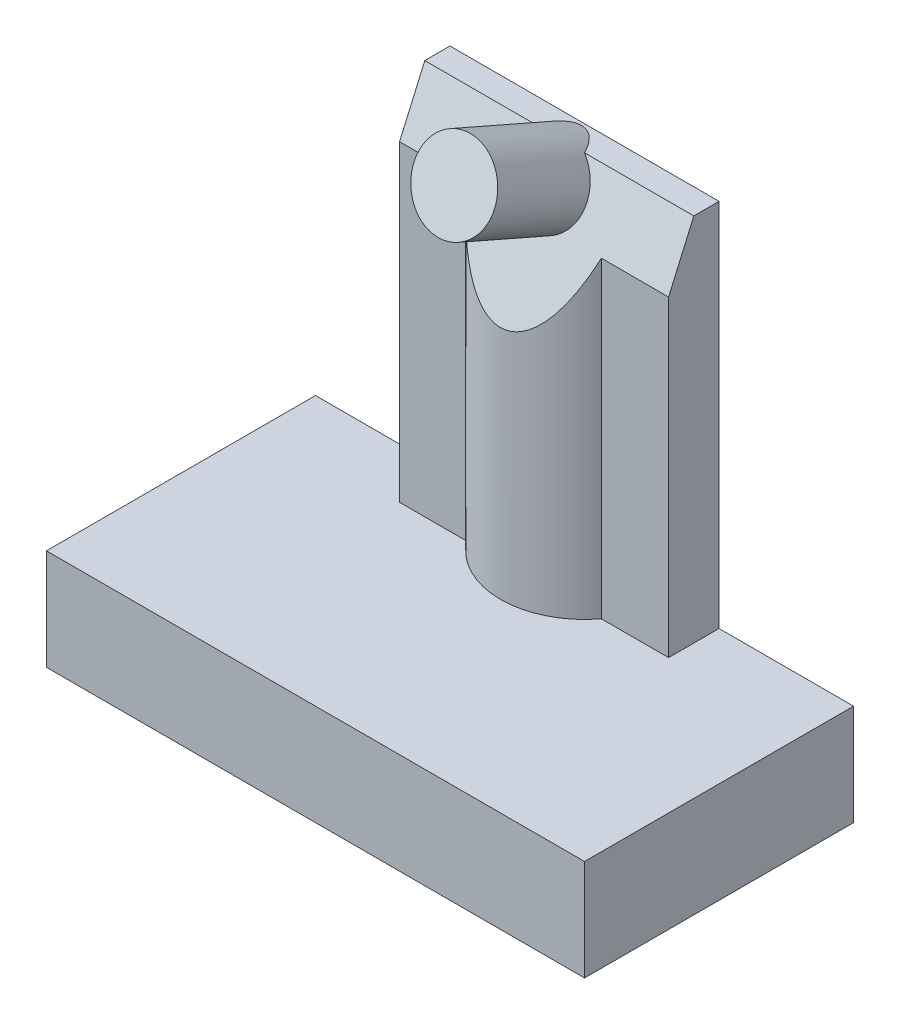
ISO-10303-21;
HEADER;
FILE_DESCRIPTION(('STEP AP214'),'2;1');
FILE_NAME('part.step','',(''),(''),'','','');
FILE_SCHEMA(('AUTOMOTIVE_DESIGN { 1 0 10303 214 1 1 1 1 }'));
ENDSEC;
DATA;
#1=APPLICATION_CONTEXT('core data for automotive mechanical design processes');
#2=APPLICATION_PROTOCOL_DEFINITION('international standard','automotive_design',2000,#1);
#3=PRODUCT_CONTEXT('',#1,'mechanical');
#4=PRODUCT('Part','Part','',(#3));
#5=PRODUCT_RELATED_PRODUCT_CATEGORY('part','',(#4));
#6=PRODUCT_DEFINITION_FORMATION('','',#4);
#7=PRODUCT_DEFINITION_CONTEXT('part definition',#1,'design');
#8=PRODUCT_DEFINITION('design','',#6,#7);
#9=PRODUCT_DEFINITION_SHAPE('','',#8);
#10=(LENGTH_UNIT() NAMED_UNIT(*) SI_UNIT(.MILLI.,.METRE.));
#11=(NAMED_UNIT(*) PLANE_ANGLE_UNIT() SI_UNIT($,.RADIAN.));
#12=(NAMED_UNIT(*) SI_UNIT($,.STERADIAN.) SOLID_ANGLE_UNIT());
#13=UNCERTAINTY_MEASURE_WITH_UNIT(LENGTH_MEASURE(1.E-05),#10,'distance_accuracy_value','');
#14=(GEOMETRIC_REPRESENTATION_CONTEXT(3) GLOBAL_UNCERTAINTY_ASSIGNED_CONTEXT((#13)) GLOBAL_UNIT_ASSIGNED_CONTEXT((#10,
#11,#12)) REPRESENTATION_CONTEXT('',''));
#15=CARTESIAN_POINT('',(0.,0.,0.));
#16=DIRECTION('',(0.,0.,1.));
#17=DIRECTION('',(1.,0.,0.));
#18=AXIS2_PLACEMENT_3D('',#15,#16,#17);
#19=CARTESIAN_POINT('',(0.,3.,0.));
#20=DIRECTION('',(0.,1.,0.));
#21=DIRECTION('',(0.,0.,1.));
#22=AXIS2_PLACEMENT_3D('',#19,#20,#21);
#23=PLANE('',#22);
#24=DIRECTION('',(-1.,0.,0.));
#25=VECTOR('',#24,1.);
#26=CARTESIAN_POINT('',(8.,3.,-4.));
#27=LINE('',#26,#25);
#28=CARTESIAN_POINT('',(8.,3.,-4.));
#29=VERTEX_POINT('',#28);
#30=CARTESIAN_POINT('',(4.,3.,-4.));
#31=VERTEX_POINT('',#30);
#32=EDGE_CURVE('E224',#29,#31,#27,.T.);
#33=ORIENTED_EDGE('',*,*,#32,.T.);
#34=DIRECTION('',(0.,0.,1.));
#35=VECTOR('',#34,1.);
#36=CARTESIAN_POINT('',(4.,3.,-4.));
#37=LINE('',#36,#35);
#38=CARTESIAN_POINT('',(4.,3.,-2.5));
#39=VERTEX_POINT('',#38);
#40=EDGE_CURVE('E289',#31,#39,#37,.T.);
#41=ORIENTED_EDGE('',*,*,#40,.T.);
#42=DIRECTION('',(-1.,0.,0.));
#43=VECTOR('',#42,1.);
#44=CARTESIAN_POINT('',(4.,3.,-2.5));
#45=LINE('',#44,#43);
#46=CARTESIAN_POINT('',(2.,3.,-2.5));
#47=VERTEX_POINT('',#46);
#48=EDGE_CURVE('E292',#39,#47,#45,.T.);
#49=ORIENTED_EDGE('',*,*,#48,.T.);
#50=CARTESIAN_POINT('',(0.,3.,-4.));
#51=DIRECTION('',(0.,1.,0.));
#52=DIRECTION('',(0.,0.,1.));
#53=AXIS2_PLACEMENT_3D('',#50,#51,#52);
#54=CIRCLE('',#53,2.5);
#55=CARTESIAN_POINT('',(-2.,3.,-2.5));
#56=VERTEX_POINT('',#55);
#57=EDGE_CURVE('E302',#56,#47,#54,.T.);
#58=ORIENTED_EDGE('',*,*,#57,.F.);
#59=DIRECTION('',(1.,0.,0.));
#60=VECTOR('',#59,1.);
#61=CARTESIAN_POINT('',(-4.,3.,-2.5));
#62=LINE('',#61,#60);
#63=CARTESIAN_POINT('',(-4.,3.,-2.5));
#64=VERTEX_POINT('',#63);
#65=EDGE_CURVE('E304',#64,#56,#62,.T.);
#66=ORIENTED_EDGE('',*,*,#65,.F.);
#67=DIRECTION('',(0.,0.,1.));
#68=VECTOR('',#67,1.);
#69=CARTESIAN_POINT('',(-4.,3.,-4.));
#70=LINE('',#69,#68);
#71=CARTESIAN_POINT('',(-4.,3.,-4.));
#72=VERTEX_POINT('',#71);
#73=EDGE_CURVE('E281',#72,#64,#70,.T.);
#74=ORIENTED_EDGE('',*,*,#73,.F.);
#75=CARTESIAN_POINT('',(-8.,3.,-4.));
#76=VERTEX_POINT('',#75);
#77=EDGE_CURVE('E229',#72,#76,#27,.T.);
#78=ORIENTED_EDGE('',*,*,#77,.T.);
#79=DIRECTION('',(0.,0.,1.));
#80=VECTOR('',#79,1.);
#81=CARTESIAN_POINT('',(-8.,3.,4.));
#82=LINE('',#81,#80);
#83=CARTESIAN_POINT('',(-8.,3.,4.));
#84=VERTEX_POINT('',#83);
#85=EDGE_CURVE('E217',#76,#84,#82,.T.);
#86=ORIENTED_EDGE('',*,*,#85,.T.);
#87=DIRECTION('',(1.,0.,0.));
#88=VECTOR('',#87,1.);
#89=CARTESIAN_POINT('',(8.,3.,4.));
#90=LINE('',#89,#88);
#91=CARTESIAN_POINT('',(8.,3.,4.));
#92=VERTEX_POINT('',#91);
#93=EDGE_CURVE('E275',#84,#92,#90,.T.);
#94=ORIENTED_EDGE('',*,*,#93,.T.);
#95=DIRECTION('',(0.,0.,-1.));
#96=VECTOR('',#95,1.);
#97=CARTESIAN_POINT('',(8.,3.,4.));
#98=LINE('',#97,#96);
#99=EDGE_CURVE('E211',#92,#29,#98,.T.);
#100=ORIENTED_EDGE('',*,*,#99,.T.);
#101=EDGE_LOOP('',(#33,#41,#49,#58,#66,#74,#78,#86,#94,#100));
#102=FACE_BOUND('',#101,.T.);
#103=ADVANCED_FACE('F32',(#102),#23,.T.);
#104=CARTESIAN_POINT('',(-8.,3.,4.));
#105=DIRECTION('',(1.,0.,0.));
#106=DIRECTION('',(0.,0.,-1.));
#107=AXIS2_PLACEMENT_3D('',#104,#105,#106);
#108=PLANE('',#107);
#109=DIRECTION('',(0.,0.,1.));
#110=VECTOR('',#109,1.);
#111=CARTESIAN_POINT('',(-8.,0.,4.));
#112=LINE('',#111,#110);
#113=CARTESIAN_POINT('',(-8.,0.,-4.));
#114=VERTEX_POINT('',#113);
#115=CARTESIAN_POINT('',(-8.,0.,4.));
#116=VERTEX_POINT('',#115);
#117=EDGE_CURVE('E207',#114,#116,#112,.T.);
#118=ORIENTED_EDGE('',*,*,#117,.T.);
#119=DIRECTION('',(0.,-1.,0.));
#120=VECTOR('',#119,1.);
#121=CARTESIAN_POINT('',(-8.,3.,4.));
#122=LINE('',#121,#120);
#123=EDGE_CURVE('E201',#84,#116,#122,.T.);
#124=ORIENTED_EDGE('',*,*,#123,.F.);
#125=ORIENTED_EDGE('',*,*,#85,.F.);
#126=DIRECTION('',(0.,-1.,0.));
#127=VECTOR('',#126,1.);
#128=CARTESIAN_POINT('',(-8.,3.,-4.));
#129=LINE('',#128,#127);
#130=EDGE_CURVE('E221',#76,#114,#129,.T.);
#131=ORIENTED_EDGE('',*,*,#130,.T.);
#132=EDGE_LOOP('',(#118,#124,#125,#131));
#133=FACE_BOUND('',#132,.T.);
#134=ADVANCED_FACE('F34',(#133),#108,.F.);
#135=CARTESIAN_POINT('',(8.,3.,4.));
#136=DIRECTION('',(0.,0.,-1.));
#137=DIRECTION('',(-1.,0.,0.));
#138=AXIS2_PLACEMENT_3D('',#135,#136,#137);
#139=PLANE('',#138);
#140=DIRECTION('',(1.,0.,0.));
#141=VECTOR('',#140,1.);
#142=CARTESIAN_POINT('',(8.,0.,4.));
#143=LINE('',#142,#141);
#144=CARTESIAN_POINT('',(8.,0.,4.));
#145=VERTEX_POINT('',#144);
#146=EDGE_CURVE('E196',#116,#145,#143,.T.);
#147=ORIENTED_EDGE('',*,*,#146,.T.);
#148=DIRECTION('',(0.,-1.,0.));
#149=VECTOR('',#148,1.);
#150=CARTESIAN_POINT('',(8.,3.,4.));
#151=LINE('',#150,#149);
#152=EDGE_CURVE('E198',#92,#145,#151,.T.);
#153=ORIENTED_EDGE('',*,*,#152,.F.);
#154=ORIENTED_EDGE('',*,*,#93,.F.);
#155=ORIENTED_EDGE('',*,*,#123,.T.);
#156=EDGE_LOOP('',(#147,#153,#154,#155));
#157=FACE_BOUND('',#156,.T.);
#158=ADVANCED_FACE('F172',(#157),#139,.F.);
#159=CARTESIAN_POINT('',(8.,3.,4.));
#160=DIRECTION('',(-1.,0.,0.));
#161=DIRECTION('',(0.,0.,1.));
#162=AXIS2_PLACEMENT_3D('',#159,#160,#161);
#163=PLANE('',#162);
#164=DIRECTION('',(0.,0.,-1.));
#165=VECTOR('',#164,1.);
#166=CARTESIAN_POINT('',(8.,0.,4.));
#167=LINE('',#166,#165);
#168=CARTESIAN_POINT('',(8.,0.,-4.));
#169=VERTEX_POINT('',#168);
#170=EDGE_CURVE('E206',#145,#169,#167,.T.);
#171=ORIENTED_EDGE('',*,*,#170,.T.);
#172=DIRECTION('',(0.,-1.,0.));
#173=VECTOR('',#172,1.);
#174=CARTESIAN_POINT('',(8.,3.,-4.));
#175=LINE('',#174,#173);
#176=EDGE_CURVE('E212',#29,#169,#175,.T.);
#177=ORIENTED_EDGE('',*,*,#176,.F.);
#178=ORIENTED_EDGE('',*,*,#99,.F.);
#179=ORIENTED_EDGE('',*,*,#152,.T.);
#180=EDGE_LOOP('',(#171,#177,#178,#179));
#181=FACE_BOUND('',#180,.T.);
#182=ADVANCED_FACE('F186',(#181),#163,.F.);
#183=CARTESIAN_POINT('',(8.,3.,-4.));
#184=DIRECTION('',(0.,0.,1.));
#185=DIRECTION('',(1.,0.,0.));
#186=AXIS2_PLACEMENT_3D('',#183,#184,#185);
#187=PLANE('',#186);
#188=DIRECTION('',(-1.,0.,0.));
#189=VECTOR('',#188,1.);
#190=CARTESIAN_POINT('',(8.,0.,-4.));
#191=LINE('',#190,#189);
#192=EDGE_CURVE('E215',#169,#114,#191,.T.);
#193=ORIENTED_EDGE('',*,*,#192,.T.);
#194=ORIENTED_EDGE('',*,*,#130,.F.);
#195=ORIENTED_EDGE('',*,*,#77,.F.);
#196=DIRECTION('',(0.,-1.,0.));
#197=VECTOR('',#196,1.);
#198=CARTESIAN_POINT('',(-4.,14.,-4.));
#199=LINE('',#198,#197);
#200=CARTESIAN_POINT('',(-4.,14.,-4.));
#201=VERTEX_POINT('',#200);
#202=EDGE_CURVE('E314',#201,#72,#199,.T.);
#203=ORIENTED_EDGE('',*,*,#202,.F.);
#204=DIRECTION('',(1.,0.,0.));
#205=VECTOR('',#204,1.);
#206=CARTESIAN_POINT('',(-4.,14.,-4.));
#207=LINE('',#206,#205);
#208=CARTESIAN_POINT('',(4.,14.,-4.));
#209=VERTEX_POINT('',#208);
#210=EDGE_CURVE('E316',#201,#209,#207,.T.);
#211=ORIENTED_EDGE('',*,*,#210,.T.);
#212=DIRECTION('',(0.,-1.,0.));
#213=VECTOR('',#212,1.);
#214=CARTESIAN_POINT('',(4.,14.,-4.));
#215=LINE('',#214,#213);
#216=EDGE_CURVE('E266',#209,#31,#215,.T.);
#217=ORIENTED_EDGE('',*,*,#216,.T.);
#218=ORIENTED_EDGE('',*,*,#32,.F.);
#219=ORIENTED_EDGE('',*,*,#176,.T.);
#220=EDGE_LOOP('',(#193,#194,#195,#203,#211,#217,#218,#219));
#221=FACE_BOUND('',#220,.T.);
#222=ADVANCED_FACE('F182',(#221),#187,.F.);
#223=CARTESIAN_POINT('',(0.,0.,0.));
#224=DIRECTION('',(0.,1.,0.));
#225=DIRECTION('',(0.,0.,1.));
#226=AXIS2_PLACEMENT_3D('',#223,#224,#225);
#227=PLANE('',#226);
#228=DIRECTION('',(-1.,0.,0.));
#229=VECTOR('',#228,1.);
#230=CARTESIAN_POINT('',(8.,0.,-3.));
#231=LINE('',#230,#229);
#232=CARTESIAN_POINT('',(7.,0.,-3.));
#233=VERTEX_POINT('',#232);
#234=CARTESIAN_POINT('',(-7.,0.,-3.));
#235=VERTEX_POINT('',#234);
#236=EDGE_CURVE('E254',#233,#235,#231,.T.);
#237=ORIENTED_EDGE('',*,*,#236,.T.);
#238=DIRECTION('',(0.,0.,1.));
#239=VECTOR('',#238,1.);
#240=CARTESIAN_POINT('',(-7.,0.,4.));
#241=LINE('',#240,#239);
#242=CARTESIAN_POINT('',(-7.,0.,3.));
#243=VERTEX_POINT('',#242);
#244=EDGE_CURVE('E263',#235,#243,#241,.T.);
#245=ORIENTED_EDGE('',*,*,#244,.T.);
#246=DIRECTION('',(1.,0.,0.));
#247=VECTOR('',#246,1.);
#248=CARTESIAN_POINT('',(8.,0.,3.));
#249=LINE('',#248,#247);
#250=CARTESIAN_POINT('',(7.,0.,3.));
#251=VERTEX_POINT('',#250);
#252=EDGE_CURVE('E265',#243,#251,#249,.T.);
#253=ORIENTED_EDGE('',*,*,#252,.T.);
#254=DIRECTION('',(0.,0.,-1.));
#255=VECTOR('',#254,1.);
#256=CARTESIAN_POINT('',(7.,0.,4.));
#257=LINE('',#256,#255);
#258=EDGE_CURVE('E269',#251,#233,#257,.T.);
#259=ORIENTED_EDGE('',*,*,#258,.T.);
#260=EDGE_LOOP('',(#237,#245,#253,#259));
#261=FACE_BOUND('',#260,.T.);
#262=ORIENTED_EDGE('',*,*,#117,.F.);
#263=ORIENTED_EDGE('',*,*,#192,.F.);
#264=ORIENTED_EDGE('',*,*,#170,.F.);
#265=ORIENTED_EDGE('',*,*,#146,.F.);
#266=EDGE_LOOP('',(#262,#263,#264,#265));
#267=FACE_BOUND('',#266,.T.);
#268=ADVANCED_FACE('F178',(#261,#267),#227,.F.);
#269=CARTESIAN_POINT('',(-7.,3.,4.));
#270=DIRECTION('',(1.,0.,0.));
#271=DIRECTION('',(0.,0.,-1.));
#272=AXIS2_PLACEMENT_3D('',#269,#270,#271);
#273=PLANE('',#272);
#274=ORIENTED_EDGE('',*,*,#244,.F.);
#275=DIRECTION('',(0.,-1.,0.));
#276=VECTOR('',#275,1.);
#277=CARTESIAN_POINT('',(-7.,3.,-3.));
#278=LINE('',#277,#276);
#279=CARTESIAN_POINT('',(-7.,2.,-3.));
#280=VERTEX_POINT('',#279);
#281=EDGE_CURVE('E255',#280,#235,#278,.T.);
#282=ORIENTED_EDGE('',*,*,#281,.F.);
#283=DIRECTION('',(0.,0.,1.));
#284=VECTOR('',#283,1.);
#285=CARTESIAN_POINT('',(-7.,2.,4.));
#286=LINE('',#285,#284);
#287=CARTESIAN_POINT('',(-7.,2.,3.));
#288=VERTEX_POINT('',#287);
#289=EDGE_CURVE('E251',#280,#288,#286,.T.);
#290=ORIENTED_EDGE('',*,*,#289,.T.);
#291=DIRECTION('',(0.,-1.,0.));
#292=VECTOR('',#291,1.);
#293=CARTESIAN_POINT('',(-7.,3.,3.));
#294=LINE('',#293,#292);
#295=EDGE_CURVE('E235',#288,#243,#294,.T.);
#296=ORIENTED_EDGE('',*,*,#295,.T.);
#297=EDGE_LOOP('',(#274,#282,#290,#296));
#298=FACE_BOUND('',#297,.T.);
#299=ADVANCED_FACE('F181',(#298),#273,.T.);
#300=CARTESIAN_POINT('',(8.,3.,3.));
#301=DIRECTION('',(0.,0.,-1.));
#302=DIRECTION('',(-1.,0.,0.));
#303=AXIS2_PLACEMENT_3D('',#300,#301,#302);
#304=PLANE('',#303);
#305=ORIENTED_EDGE('',*,*,#252,.F.);
#306=ORIENTED_EDGE('',*,*,#295,.F.);
#307=DIRECTION('',(1.,0.,0.));
#308=VECTOR('',#307,1.);
#309=CARTESIAN_POINT('',(8.,2.,3.));
#310=LINE('',#309,#308);
#311=CARTESIAN_POINT('',(7.,2.,3.));
#312=VERTEX_POINT('',#311);
#313=EDGE_CURVE('E253',#288,#312,#310,.T.);
#314=ORIENTED_EDGE('',*,*,#313,.T.);
#315=DIRECTION('',(0.,-1.,0.));
#316=VECTOR('',#315,1.);
#317=CARTESIAN_POINT('',(7.,3.,3.));
#318=LINE('',#317,#316);
#319=EDGE_CURVE('E237',#312,#251,#318,.T.);
#320=ORIENTED_EDGE('',*,*,#319,.T.);
#321=EDGE_LOOP('',(#305,#306,#314,#320));
#322=FACE_BOUND('',#321,.T.);
#323=ADVANCED_FACE('F443',(#322),#304,.T.);
#324=CARTESIAN_POINT('',(7.,3.,4.));
#325=DIRECTION('',(-1.,0.,0.));
#326=DIRECTION('',(0.,0.,1.));
#327=AXIS2_PLACEMENT_3D('',#324,#325,#326);
#328=PLANE('',#327);
#329=ORIENTED_EDGE('',*,*,#258,.F.);
#330=ORIENTED_EDGE('',*,*,#319,.F.);
#331=DIRECTION('',(0.,0.,-1.));
#332=VECTOR('',#331,1.);
#333=CARTESIAN_POINT('',(7.,2.,4.));
#334=LINE('',#333,#332);
#335=CARTESIAN_POINT('',(7.,2.,-3.));
#336=VERTEX_POINT('',#335);
#337=EDGE_CURVE('E259',#312,#336,#334,.T.);
#338=ORIENTED_EDGE('',*,*,#337,.T.);
#339=DIRECTION('',(0.,-1.,0.));
#340=VECTOR('',#339,1.);
#341=CARTESIAN_POINT('',(7.,3.,-3.));
#342=LINE('',#341,#340);
#343=EDGE_CURVE('E245',#336,#233,#342,.T.);
#344=ORIENTED_EDGE('',*,*,#343,.T.);
#345=EDGE_LOOP('',(#329,#330,#338,#344));
#346=FACE_BOUND('',#345,.T.);
#347=ADVANCED_FACE('F434',(#346),#328,.T.);
#348=CARTESIAN_POINT('',(8.,3.,-3.));
#349=DIRECTION('',(0.,0.,1.));
#350=DIRECTION('',(1.,0.,0.));
#351=AXIS2_PLACEMENT_3D('',#348,#349,#350);
#352=PLANE('',#351);
#353=ORIENTED_EDGE('',*,*,#236,.F.);
#354=ORIENTED_EDGE('',*,*,#343,.F.);
#355=DIRECTION('',(-1.,0.,0.));
#356=VECTOR('',#355,1.);
#357=CARTESIAN_POINT('',(8.,2.,-3.));
#358=LINE('',#357,#356);
#359=EDGE_CURVE('E256',#336,#280,#358,.T.);
#360=ORIENTED_EDGE('',*,*,#359,.T.);
#361=ORIENTED_EDGE('',*,*,#281,.T.);
#362=EDGE_LOOP('',(#353,#354,#360,#361));
#363=FACE_BOUND('',#362,.T.);
#364=ADVANCED_FACE('F425',(#363),#352,.T.);
#365=CARTESIAN_POINT('',(0.,2.,0.));
#366=DIRECTION('',(0.,1.,0.));
#367=DIRECTION('',(0.,0.,1.));
#368=AXIS2_PLACEMENT_3D('',#365,#366,#367);
#369=PLANE('',#368);
#370=ORIENTED_EDGE('',*,*,#289,.F.);
#371=ORIENTED_EDGE('',*,*,#359,.F.);
#372=ORIENTED_EDGE('',*,*,#337,.F.);
#373=ORIENTED_EDGE('',*,*,#313,.F.);
#374=EDGE_LOOP('',(#370,#371,#372,#373));
#375=FACE_BOUND('',#374,.T.);
#376=ADVANCED_FACE('F176',(#375),#369,.F.);
#377=CARTESIAN_POINT('',(4.,14.,-4.));
#378=DIRECTION('',(1.,0.,0.));
#379=DIRECTION('',(0.,0.,-1.));
#380=AXIS2_PLACEMENT_3D('',#377,#378,#379);
#381=PLANE('',#380);
#382=DIRECTION('',(0.,0.916157334902189,-0.400818834019708));
#383=VECTOR('',#382,1.);
#384=CARTESIAN_POINT('',(4.,14.,-3.25));
#385=LINE('',#384,#383);
#386=CARTESIAN_POINT('',(4.,12.2857142857143,-2.5));
#387=VERTEX_POINT('',#386);
#388=CARTESIAN_POINT('',(4.,14.,-3.25));
#389=VERTEX_POINT('',#388);
#390=EDGE_CURVE('E54',#387,#389,#385,.T.);
#391=ORIENTED_EDGE('',*,*,#390,.F.);
#392=DIRECTION('',(0.,-1.,0.));
#393=VECTOR('',#392,1.);
#394=CARTESIAN_POINT('',(4.,14.,-2.5));
#395=LINE('',#394,#393);
#396=EDGE_CURVE('E249',#387,#39,#395,.T.);
#397=ORIENTED_EDGE('',*,*,#396,.T.);
#398=ORIENTED_EDGE('',*,*,#40,.F.);
#399=ORIENTED_EDGE('',*,*,#216,.F.);
#400=DIRECTION('',(0.,0.,1.));
#401=VECTOR('',#400,1.);
#402=CARTESIAN_POINT('',(4.,14.,-4.));
#403=LINE('',#402,#401);
#404=EDGE_CURVE('E319',#209,#389,#403,.T.);
#405=ORIENTED_EDGE('',*,*,#404,.T.);
#406=EDGE_LOOP('',(#391,#397,#398,#399,#405));
#407=FACE_BOUND('',#406,.T.);
#408=ADVANCED_FACE('F396',(#407),#381,.T.);
#409=CARTESIAN_POINT('',(-4.,14.,-4.));
#410=DIRECTION('',(1.,0.,0.));
#411=DIRECTION('',(0.,0.,-1.));
#412=AXIS2_PLACEMENT_3D('',#409,#410,#411);
#413=PLANE('',#412);
#414=DIRECTION('',(0.,-1.,0.));
#415=VECTOR('',#414,1.);
#416=CARTESIAN_POINT('',(-4.,14.,-2.5));
#417=LINE('',#416,#415);
#418=CARTESIAN_POINT('',(-4.,12.2857142857143,-2.5));
#419=VERTEX_POINT('',#418);
#420=EDGE_CURVE('E312',#419,#64,#417,.T.);
#421=ORIENTED_EDGE('',*,*,#420,.F.);
#422=DIRECTION('',(0.,0.916157334902189,-0.400818834019708));
#423=VECTOR('',#422,1.);
#424=CARTESIAN_POINT('',(-4.,14.2754098360656,-3.37049180327869));
#425=LINE('',#424,#423);
#426=CARTESIAN_POINT('',(-4.,14.,-3.25));
#427=VERTEX_POINT('',#426);
#428=EDGE_CURVE('E295',#419,#427,#425,.T.);
#429=ORIENTED_EDGE('',*,*,#428,.T.);
#430=DIRECTION('',(0.,0.,1.));
#431=VECTOR('',#430,1.);
#432=CARTESIAN_POINT('',(-4.,14.,-4.));
#433=LINE('',#432,#431);
#434=EDGE_CURVE('E317',#201,#427,#433,.T.);
#435=ORIENTED_EDGE('',*,*,#434,.F.);
#436=ORIENTED_EDGE('',*,*,#202,.T.);
#437=ORIENTED_EDGE('',*,*,#73,.T.);
#438=EDGE_LOOP('',(#421,#429,#435,#436,#437));
#439=FACE_BOUND('',#438,.T.);
#440=ADVANCED_FACE('F386',(#439),#413,.F.);
#441=CARTESIAN_POINT('',(-4.,14.,-2.5));
#442=DIRECTION('',(0.,0.,-1.));
#443=DIRECTION('',(-1.,0.,0.));
#444=AXIS2_PLACEMENT_3D('',#441,#442,#443);
#445=PLANE('',#444);
#446=DIRECTION('',(0.,-1.,0.));
#447=VECTOR('',#446,1.);
#448=CARTESIAN_POINT('',(-2.,14.,-2.5));
#449=LINE('',#448,#447);
#450=CARTESIAN_POINT('',(-2.,12.2857142857143,-2.5));
#451=VERTEX_POINT('',#450);
#452=EDGE_CURVE('E315',#451,#56,#449,.T.);
#453=ORIENTED_EDGE('',*,*,#452,.F.);
#454=DIRECTION('',(-1.,0.,0.));
#455=VECTOR('',#454,1.);
#456=CARTESIAN_POINT('',(-4.,12.2857142857143,-2.5));
#457=LINE('',#456,#455);
#458=EDGE_CURVE('E325',#451,#419,#457,.T.);
#459=ORIENTED_EDGE('',*,*,#458,.T.);
#460=ORIENTED_EDGE('',*,*,#420,.T.);
#461=ORIENTED_EDGE('',*,*,#65,.T.);
#462=EDGE_LOOP('',(#453,#459,#460,#461));
#463=FACE_BOUND('',#462,.T.);
#464=ADVANCED_FACE('F376',(#463),#445,.F.);
#465=CARTESIAN_POINT('',(0.,14.,-4.));
#466=DIRECTION('',(0.,-1.,0.));
#467=DIRECTION('',(0.,0.,-1.));
#468=AXIS2_PLACEMENT_3D('',#465,#466,#467);
#469=CYLINDRICAL_SURFACE('',#468,2.5);
#470=CARTESIAN_POINT('',(0.,15.7142857142857,-4.));
#471=DIRECTION('',(0.,-0.400818834019708,-0.916157334902189));
#472=DIRECTION('',(0.,-0.916157334902189,0.400818834019708));
#473=AXIS2_PLACEMENT_3D('',#470,#471,#472);
#474=ELLIPSE('',#473,6.23723185591892,2.5);
#475=CARTESIAN_POINT('',(2.,12.2857142857143,-2.5));
#476=VERTEX_POINT('',#475);
#477=EDGE_CURVE('E328',#476,#451,#474,.T.);
#478=ORIENTED_EDGE('',*,*,#477,.T.);
#479=ORIENTED_EDGE('',*,*,#452,.T.);
#480=ORIENTED_EDGE('',*,*,#57,.T.);
#481=DIRECTION('',(0.,-1.,0.));
#482=VECTOR('',#481,1.);
#483=CARTESIAN_POINT('',(2.,14.,-2.5));
#484=LINE('',#483,#482);
#485=EDGE_CURVE('E301',#476,#47,#484,.T.);
#486=ORIENTED_EDGE('',*,*,#485,.F.);
#487=EDGE_LOOP('',(#478,#479,#480,#486));
#488=FACE_BOUND('',#487,.T.);
#489=ADVANCED_FACE('F367',(#488),#469,.T.);
#490=CARTESIAN_POINT('',(4.,14.,-2.5));
#491=DIRECTION('',(0.,0.,1.));
#492=DIRECTION('',(1.,0.,0.));
#493=AXIS2_PLACEMENT_3D('',#490,#491,#492);
#494=PLANE('',#493);
#495=DIRECTION('',(1.,0.,0.));
#496=VECTOR('',#495,1.);
#497=CARTESIAN_POINT('',(4.,12.2857142857143,-2.5));
#498=LINE('',#497,#496);
#499=EDGE_CURVE('E330',#476,#387,#498,.T.);
#500=ORIENTED_EDGE('',*,*,#499,.F.);
#501=ORIENTED_EDGE('',*,*,#485,.T.);
#502=ORIENTED_EDGE('',*,*,#48,.F.);
#503=ORIENTED_EDGE('',*,*,#396,.F.);
#504=EDGE_LOOP('',(#500,#501,#502,#503));
#505=FACE_BOUND('',#504,.T.);
#506=ADVANCED_FACE('F164',(#505),#494,.T.);
#507=CARTESIAN_POINT('',(0.,14.,-4.));
#508=DIRECTION('',(0.,1.,0.));
#509=DIRECTION('',(0.,0.,1.));
#510=AXIS2_PLACEMENT_3D('',#507,#508,#509);
#511=PLANE('',#510);
#512=CARTESIAN_POINT('',(0.,14.00000000001,-0.916312570439004));
#513=DIRECTION('',(0.,1.,0.));
#514=DIRECTION('',(0.,0.,1.));
#515=AXIS2_PLACEMENT_3D('',#512,#513,#514);
#516=ELLIPSE('',#515,2.99387129084108,1.2);
#517=CARTESIAN_POINT('',(-0.751700249997855,14.,-3.25));
#518=VERTEX_POINT('',#517);
#519=CARTESIAN_POINT('',(0.751700249975699,14.,-3.25));
#520=VERTEX_POINT('',#519);
#521=EDGE_CURVE('E47',#518,#520,#516,.F.);
#522=ORIENTED_EDGE('',*,*,#521,.T.);
#523=DIRECTION('',(-1.,0.,0.));
#524=VECTOR('',#523,1.);
#525=CARTESIAN_POINT('',(0.,14.,-3.25));
#526=LINE('',#525,#524);
#527=EDGE_CURVE('E11',#389,#520,#526,.T.);
#528=ORIENTED_EDGE('',*,*,#527,.F.);
#529=ORIENTED_EDGE('',*,*,#404,.F.);
#530=ORIENTED_EDGE('',*,*,#210,.F.);
#531=ORIENTED_EDGE('',*,*,#434,.T.);
#532=EDGE_CURVE('E36',#518,#427,#526,.T.);
#533=ORIENTED_EDGE('',*,*,#532,.F.);
#534=EDGE_LOOP('',(#522,#528,#529,#530,#531,#533));
#535=FACE_BOUND('',#534,.T.);
#536=ADVANCED_FACE('F150',(#535),#511,.T.);
#537=CARTESIAN_POINT('',(-8.000025,14.,-3.25));
#538=DIRECTION('',(0.,-0.400818834019708,-0.916157334902189));
#539=DIRECTION('',(0.,0.916157334902189,-0.400818834019708));
#540=AXIS2_PLACEMENT_3D('',#537,#538,#539);
#541=PLANE('',#540);
#542=ORIENTED_EDGE('',*,*,#527,.T.);
#543=CARTESIAN_POINT('',(0.,13.1430393701265,-2.87507972443033));
#544=DIRECTION('',(0.,0.400818834019708,0.916157334902189));
#545=DIRECTION('',(0.,-0.916157334902189,0.400818834019708));
#546=AXIS2_PLACEMENT_3D('',#543,#544,#545);
#547=CIRCLE('',#546,1.2);
#548=EDGE_CURVE('E143',#518,#520,#547,.T.);
#549=ORIENTED_EDGE('',*,*,#548,.F.);
#550=ORIENTED_EDGE('',*,*,#532,.T.);
#551=ORIENTED_EDGE('',*,*,#428,.F.);
#552=ORIENTED_EDGE('',*,*,#458,.F.);
#553=ORIENTED_EDGE('',*,*,#477,.F.);
#554=ORIENTED_EDGE('',*,*,#499,.T.);
#555=ORIENTED_EDGE('',*,*,#390,.T.);
#556=EDGE_LOOP('',(#542,#549,#550,#551,#552,#553,#554,#555));
#557=FACE_BOUND('',#556,.T.);
#558=ADVANCED_FACE('F155',(#557),#541,.F.);
#559=CARTESIAN_POINT('',(0.,-218735.809543138,-500000.480982601));
#560=DIRECTION('',(0.,0.400818834019708,0.916157334902189));
#561=DIRECTION('',(0.,-0.916157334902189,0.400818834019708));
#562=AXIS2_PLACEMENT_3D('',#559,#560,#561);
#563=CYLINDRICAL_SURFACE('',#562,1.2);
#564=ORIENTED_EDGE('',*,*,#521,.F.);
#565=ORIENTED_EDGE('',*,*,#548,.T.);
#566=EDGE_LOOP('',(#564,#565));
#567=FACE_BOUND('',#566,.T.);
#568=CARTESIAN_POINT('',(0.,14.3454958721856,-0.126607719723763));
#569=DIRECTION('',(0.,0.400818834019708,0.916157334902189));
#570=DIRECTION('',(0.,-0.916157334902189,0.400818834019708));
#571=AXIS2_PLACEMENT_3D('',#568,#569,#570);
#572=CIRCLE('',#571,1.2);
#573=CARTESIAN_POINT('',(0.,13.246107070303,0.354374881099886));
#574=VERTEX_POINT('',#573);
#575=EDGE_CURVE('E147',#574,#574,#572,.T.);
#576=ORIENTED_EDGE('',*,*,#575,.F.);
#577=EDGE_LOOP('',(#576));
#578=FACE_BOUND('',#577,.T.);
#579=ADVANCED_FACE('F144',(#567,#578),#563,.T.);
#580=CARTESIAN_POINT('',(0.,14.3454958721856,-0.126607719723763));
#581=DIRECTION('',(0.,0.400818834019708,0.916157334902189));
#582=DIRECTION('',(0.,-0.916157334902189,0.400818834019708));
#583=AXIS2_PLACEMENT_3D('',#580,#581,#582);
#584=PLANE('',#583);
#585=ORIENTED_EDGE('',*,*,#575,.T.);
#586=EDGE_LOOP('',(#585));
#587=FACE_BOUND('',#586,.T.);
#588=ADVANCED_FACE('F162',(#587),#584,.T.);
#589=CLOSED_SHELL('',(#103,#134,#158,#182,#222,#268,#299,#323,#347,#364,#376,#408,#440,#464,
#489,#506,#536,#558,#579,#588));
#590=MANIFOLD_SOLID_BREP('B2',#589);
#591=ADVANCED_BREP_SHAPE_REPRESENTATION('',(#18,#590),#14);
#592=SHAPE_DEFINITION_REPRESENTATION(#9,#591);
ENDSEC;
END-ISO-10303-21;
